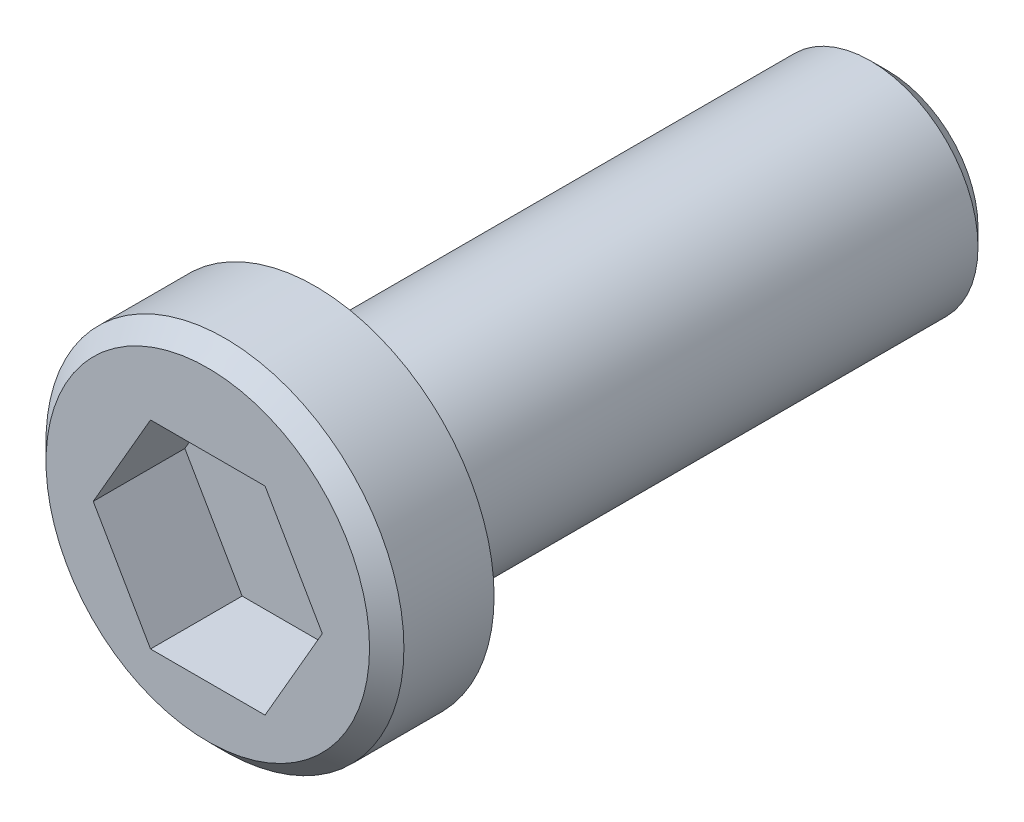
ISO-10303-21;
HEADER;
FILE_DESCRIPTION(('STEP AP214'),'2;1');
FILE_NAME('part.step','',(''),(''),'','','');
FILE_SCHEMA(('AUTOMOTIVE_DESIGN { 1 0 10303 214 1 1 1 1 }'));
ENDSEC;
DATA;
#1=APPLICATION_CONTEXT('core data for automotive mechanical design processes');
#2=APPLICATION_PROTOCOL_DEFINITION('international standard','automotive_design',2000,#1);
#3=PRODUCT_CONTEXT('',#1,'mechanical');
#4=PRODUCT('Part','Part','',(#3));
#5=PRODUCT_RELATED_PRODUCT_CATEGORY('part','',(#4));
#6=PRODUCT_DEFINITION_FORMATION('','',#4);
#7=PRODUCT_DEFINITION_CONTEXT('part definition',#1,'design');
#8=PRODUCT_DEFINITION('design','',#6,#7);
#9=PRODUCT_DEFINITION_SHAPE('','',#8);
#10=(LENGTH_UNIT() NAMED_UNIT(*) SI_UNIT(.MILLI.,.METRE.));
#11=(NAMED_UNIT(*) PLANE_ANGLE_UNIT() SI_UNIT($,.RADIAN.));
#12=(NAMED_UNIT(*) SI_UNIT($,.STERADIAN.) SOLID_ANGLE_UNIT());
#13=UNCERTAINTY_MEASURE_WITH_UNIT(LENGTH_MEASURE(1.E-05),#10,'distance_accuracy_value','');
#14=(GEOMETRIC_REPRESENTATION_CONTEXT(3) GLOBAL_UNCERTAINTY_ASSIGNED_CONTEXT((#13)) GLOBAL_UNIT_ASSIGNED_CONTEXT((#10,
#11,#12)) REPRESENTATION_CONTEXT('',''));
#15=CARTESIAN_POINT('',(0.,0.,0.));
#16=DIRECTION('',(0.,0.,1.));
#17=DIRECTION('',(1.,0.,0.));
#18=AXIS2_PLACEMENT_3D('',#15,#16,#17);
#19=CARTESIAN_POINT('',(0.,0.,25.4));
#20=DIRECTION('',(0.,0.,-1.));
#21=DIRECTION('',(-1.,0.,0.));
#22=AXIS2_PLACEMENT_3D('',#19,#20,#21);
#23=CYLINDRICAL_SURFACE('',#22,4.7625);
#24=CARTESIAN_POINT('',(0.,0.,0.761999999999999));
#25=DIRECTION('',(0.,0.,1.));
#26=DIRECTION('',(1.,0.,0.));
#27=AXIS2_PLACEMENT_3D('',#24,#25,#26);
#28=CIRCLE('',#27,4.7625);
#29=CARTESIAN_POINT('',(4.7625,0.,0.761999999999999));
#30=VERTEX_POINT('',#29);
#31=EDGE_CURVE('E147',#30,#30,#28,.T.);
#32=ORIENTED_EDGE('',*,*,#31,.T.);
#33=EDGE_LOOP('',(#32));
#34=FACE_BOUND('',#33,.T.);
#35=CARTESIAN_POINT('',(0.,0.,25.4));
#36=DIRECTION('',(0.,0.,1.));
#37=DIRECTION('',(1.,0.,0.));
#38=AXIS2_PLACEMENT_3D('',#35,#36,#37);
#39=CIRCLE('',#38,4.7625);
#40=CARTESIAN_POINT('',(4.7625,0.,25.4));
#41=VERTEX_POINT('',#40);
#42=EDGE_CURVE('E144',#41,#41,#39,.T.);
#43=ORIENTED_EDGE('',*,*,#42,.F.);
#44=EDGE_LOOP('',(#43));
#45=FACE_BOUND('',#44,.T.);
#46=ADVANCED_FACE('F34',(#34,#45),#23,.T.);
#47=CARTESIAN_POINT('',(0.,0.,0.));
#48=DIRECTION('',(0.,0.,1.));
#49=DIRECTION('',(1.,0.,0.));
#50=AXIS2_PLACEMENT_3D('',#47,#48,#49);
#51=PLANE('',#50);
#52=CARTESIAN_POINT('',(0.,0.,0.));
#53=DIRECTION('',(0.,0.,1.));
#54=DIRECTION('',(1.,0.,0.));
#55=AXIS2_PLACEMENT_3D('',#52,#53,#54);
#56=CIRCLE('',#55,4.0005);
#57=CARTESIAN_POINT('',(4.0005,0.,0.));
#58=VERTEX_POINT('',#57);
#59=EDGE_CURVE('E150',#58,#58,#56,.F.);
#60=ORIENTED_EDGE('',*,*,#59,.T.);
#61=EDGE_LOOP('',(#60));
#62=FACE_BOUND('',#61,.T.);
#63=ADVANCED_FACE('F170',(#62),#51,.F.);
#64=CARTESIAN_POINT('',(0.,0.491553117569765,25.4));
#65=DIRECTION('',(0.,0.,1.));
#66=DIRECTION('',(1.,0.,0.));
#67=AXIS2_PLACEMENT_3D('',#64,#65,#66);
#68=PLANE('',#67);
#69=CARTESIAN_POINT('',(0.,0.491553117569765,25.4));
#70=DIRECTION('',(0.,0.,1.));
#71=DIRECTION('',(1.,0.,0.));
#72=AXIS2_PLACEMENT_3D('',#69,#70,#71);
#73=CIRCLE('',#72,7.9375);
#74=CARTESIAN_POINT('',(7.9375,0.491553117569765,25.4));
#75=VERTEX_POINT('',#74);
#76=EDGE_CURVE('E136',#75,#75,#73,.T.);
#77=ORIENTED_EDGE('',*,*,#76,.F.);
#78=EDGE_LOOP('',(#77));
#79=FACE_BOUND('',#78,.T.);
#80=ORIENTED_EDGE('',*,*,#42,.T.);
#81=EDGE_LOOP('',(#80));
#82=FACE_BOUND('',#81,.T.);
#83=ADVANCED_FACE('F176',(#79,#82),#68,.F.);
#84=CARTESIAN_POINT('',(0.,0.491553117569765,30.1625));
#85=DIRECTION('',(0.,0.,-1.));
#86=DIRECTION('',(-1.,0.,0.));
#87=AXIS2_PLACEMENT_3D('',#84,#85,#86);
#88=CYLINDRICAL_SURFACE('',#87,7.9375);
#89=CARTESIAN_POINT('',(0.,0.491553117569765,29.4005));
#90=DIRECTION('',(0.,0.,1.));
#91=DIRECTION('',(1.,0.,0.));
#92=AXIS2_PLACEMENT_3D('',#89,#90,#91);
#93=CIRCLE('',#92,7.9375);
#94=CARTESIAN_POINT('',(7.9375,0.491553117569765,29.4005));
#95=VERTEX_POINT('',#94);
#96=EDGE_CURVE('E11',#95,#95,#93,.F.);
#97=ORIENTED_EDGE('',*,*,#96,.T.);
#98=EDGE_LOOP('',(#97));
#99=FACE_BOUND('',#98,.T.);
#100=ORIENTED_EDGE('',*,*,#76,.T.);
#101=EDGE_LOOP('',(#100));
#102=FACE_BOUND('',#101,.T.);
#103=ADVANCED_FACE('F181',(#99,#102),#88,.T.);
#104=CARTESIAN_POINT('',(0.,0.491553117569765,30.1625));
#105=DIRECTION('',(0.,0.,1.));
#106=DIRECTION('',(1.,0.,0.));
#107=AXIS2_PLACEMENT_3D('',#104,#105,#106);
#108=PLANE('',#107);
#109=DIRECTION('',(0.499999999999999,0.866025403784439,0.));
#110=VECTOR('',#109,1.);
#111=CARTESIAN_POINT('',(2.54,-4.39940905122495,30.1625));
#112=LINE('',#111,#110);
#113=CARTESIAN_POINT('',(2.54,-4.39940905122495,30.1625));
#114=VERTEX_POINT('',#113);
#115=CARTESIAN_POINT('',(5.08,0.,30.1625));
#116=VERTEX_POINT('',#115);
#117=EDGE_CURVE('E49',#114,#116,#112,.T.);
#118=ORIENTED_EDGE('',*,*,#117,.F.);
#119=DIRECTION('',(1.,0.,0.));
#120=VECTOR('',#119,1.);
#121=CARTESIAN_POINT('',(-2.54,-4.39940905122495,30.1625));
#122=LINE('',#121,#120);
#123=CARTESIAN_POINT('',(-2.54,-4.39940905122495,30.1625));
#124=VERTEX_POINT('',#123);
#125=EDGE_CURVE('E132',#124,#114,#122,.T.);
#126=ORIENTED_EDGE('',*,*,#125,.F.);
#127=DIRECTION('',(0.5,-0.866025403784438,0.));
#128=VECTOR('',#127,1.);
#129=CARTESIAN_POINT('',(-5.08,0.,30.1625));
#130=LINE('',#129,#128);
#131=CARTESIAN_POINT('',(-5.08,0.,30.1625));
#132=VERTEX_POINT('',#131);
#133=EDGE_CURVE('E130',#132,#124,#130,.T.);
#134=ORIENTED_EDGE('',*,*,#133,.F.);
#135=DIRECTION('',(-0.5,-0.866025403784439,0.));
#136=VECTOR('',#135,1.);
#137=CARTESIAN_POINT('',(-2.54,4.39940905122495,30.1625));
#138=LINE('',#137,#136);
#139=CARTESIAN_POINT('',(-2.54,4.39940905122495,30.1625));
#140=VERTEX_POINT('',#139);
#141=EDGE_CURVE('E97',#140,#132,#138,.T.);
#142=ORIENTED_EDGE('',*,*,#141,.F.);
#143=DIRECTION('',(-1.,0.,0.));
#144=VECTOR('',#143,1.);
#145=CARTESIAN_POINT('',(2.54,4.39940905122495,30.1625));
#146=LINE('',#145,#144);
#147=CARTESIAN_POINT('',(2.54,4.39940905122495,30.1625));
#148=VERTEX_POINT('',#147);
#149=EDGE_CURVE('E126',#148,#140,#146,.T.);
#150=ORIENTED_EDGE('',*,*,#149,.F.);
#151=DIRECTION('',(-0.5,0.866025403784438,0.));
#152=VECTOR('',#151,1.);
#153=CARTESIAN_POINT('',(5.08,0.,30.1625));
#154=LINE('',#153,#152);
#155=EDGE_CURVE('E123',#116,#148,#154,.T.);
#156=ORIENTED_EDGE('',*,*,#155,.F.);
#157=EDGE_LOOP('',(#118,#126,#134,#142,#150,#156));
#158=FACE_BOUND('',#157,.T.);
#159=CARTESIAN_POINT('',(0.,0.491553117569765,30.1625));
#160=DIRECTION('',(0.,0.,1.));
#161=DIRECTION('',(1.,0.,0.));
#162=AXIS2_PLACEMENT_3D('',#159,#160,#161);
#163=CIRCLE('',#162,7.1755);
#164=CARTESIAN_POINT('',(7.1755,0.491553117569765,30.1625));
#165=VERTEX_POINT('',#164);
#166=EDGE_CURVE('E42',#165,#165,#163,.T.);
#167=ORIENTED_EDGE('',*,*,#166,.T.);
#168=EDGE_LOOP('',(#167));
#169=FACE_BOUND('',#168,.T.);
#170=ADVANCED_FACE('F155',(#158,#169),#108,.T.);
#171=CARTESIAN_POINT('',(0.,0.,0.761999999999999));
#172=DIRECTION('',(0.,0.,1.));
#173=DIRECTION('',(1.,0.,0.));
#174=AXIS2_PLACEMENT_3D('',#171,#172,#173);
#175=CONICAL_SURFACE('',#174,4.7625,0.78539816339745);
#176=ORIENTED_EDGE('',*,*,#59,.F.);
#177=EDGE_LOOP('',(#176));
#178=FACE_BOUND('',#177,.T.);
#179=ORIENTED_EDGE('',*,*,#31,.F.);
#180=EDGE_LOOP('',(#179));
#181=FACE_BOUND('',#180,.T.);
#182=ADVANCED_FACE('F159',(#178,#181),#175,.T.);
#183=CARTESIAN_POINT('',(0.,0.491553117569765,30.1625));
#184=DIRECTION('',(0.,0.,-1.));
#185=DIRECTION('',(-1.,0.,0.));
#186=AXIS2_PLACEMENT_3D('',#183,#184,#185);
#187=CONICAL_SURFACE('',#186,7.1755,0.785398163397444);
#188=ORIENTED_EDGE('',*,*,#96,.F.);
#189=EDGE_LOOP('',(#188));
#190=FACE_BOUND('',#189,.T.);
#191=ORIENTED_EDGE('',*,*,#166,.F.);
#192=EDGE_LOOP('',(#191));
#193=FACE_BOUND('',#192,.T.);
#194=ADVANCED_FACE('F36',(#190,#193),#187,.T.);
#195=CARTESIAN_POINT('',(2.54,-4.39940905122495,26.0985));
#196=DIRECTION('',(0.866025403784439,-0.5,0.));
#197=DIRECTION('',(0.5,0.866025403784439,0.));
#198=AXIS2_PLACEMENT_3D('',#195,#196,#197);
#199=PLANE('',#198);
#200=ORIENTED_EDGE('',*,*,#117,.T.);
#201=DIRECTION('',(0.,0.,1.));
#202=VECTOR('',#201,1.);
#203=CARTESIAN_POINT('',(5.08,0.,26.0985));
#204=LINE('',#203,#202);
#205=CARTESIAN_POINT('',(5.08,0.,26.0985));
#206=VERTEX_POINT('',#205);
#207=EDGE_CURVE('E79',#206,#116,#204,.T.);
#208=ORIENTED_EDGE('',*,*,#207,.F.);
#209=DIRECTION('',(0.499999999999999,0.866025403784439,0.));
#210=VECTOR('',#209,1.);
#211=CARTESIAN_POINT('',(2.54,-4.39940905122495,26.0985));
#212=LINE('',#211,#210);
#213=CARTESIAN_POINT('',(2.54,-4.39940905122495,26.0985));
#214=VERTEX_POINT('',#213);
#215=EDGE_CURVE('E134',#214,#206,#212,.T.);
#216=ORIENTED_EDGE('',*,*,#215,.F.);
#217=DIRECTION('',(0.,0.,1.));
#218=VECTOR('',#217,1.);
#219=CARTESIAN_POINT('',(2.54,-4.39940905122495,26.0985));
#220=LINE('',#219,#218);
#221=EDGE_CURVE('E57',#214,#114,#220,.T.);
#222=ORIENTED_EDGE('',*,*,#221,.T.);
#223=EDGE_LOOP('',(#200,#208,#216,#222));
#224=FACE_BOUND('',#223,.T.);
#225=ADVANCED_FACE('F158',(#224),#199,.F.);
#226=CARTESIAN_POINT('',(-2.54,-4.39940905122495,26.0985));
#227=DIRECTION('',(0.,-1.,0.));
#228=DIRECTION('',(1.,0.,0.));
#229=AXIS2_PLACEMENT_3D('',#226,#227,#228);
#230=PLANE('',#229);
#231=ORIENTED_EDGE('',*,*,#125,.T.);
#232=ORIENTED_EDGE('',*,*,#221,.F.);
#233=DIRECTION('',(1.,0.,0.));
#234=VECTOR('',#233,1.);
#235=CARTESIAN_POINT('',(-2.54,-4.39940905122495,26.0985));
#236=LINE('',#235,#234);
#237=CARTESIAN_POINT('',(-2.54,-4.39940905122495,26.0985));
#238=VERTEX_POINT('',#237);
#239=EDGE_CURVE('E109',#238,#214,#236,.T.);
#240=ORIENTED_EDGE('',*,*,#239,.F.);
#241=DIRECTION('',(0.,0.,1.));
#242=VECTOR('',#241,1.);
#243=CARTESIAN_POINT('',(-2.54,-4.39940905122495,26.0985));
#244=LINE('',#243,#242);
#245=EDGE_CURVE('E101',#238,#124,#244,.T.);
#246=ORIENTED_EDGE('',*,*,#245,.T.);
#247=EDGE_LOOP('',(#231,#232,#240,#246));
#248=FACE_BOUND('',#247,.T.);
#249=ADVANCED_FACE('F165',(#248),#230,.F.);
#250=CARTESIAN_POINT('',(-5.08,0.,26.0985));
#251=DIRECTION('',(-0.866025403784439,-0.5,0.));
#252=DIRECTION('',(0.5,-0.866025403784439,0.));
#253=AXIS2_PLACEMENT_3D('',#250,#251,#252);
#254=PLANE('',#253);
#255=ORIENTED_EDGE('',*,*,#133,.T.);
#256=ORIENTED_EDGE('',*,*,#245,.F.);
#257=DIRECTION('',(0.5,-0.866025403784438,0.));
#258=VECTOR('',#257,1.);
#259=CARTESIAN_POINT('',(-5.08,0.,26.0985));
#260=LINE('',#259,#258);
#261=CARTESIAN_POINT('',(-5.08,0.,26.0985));
#262=VERTEX_POINT('',#261);
#263=EDGE_CURVE('E105',#262,#238,#260,.T.);
#264=ORIENTED_EDGE('',*,*,#263,.F.);
#265=DIRECTION('',(0.,0.,1.));
#266=VECTOR('',#265,1.);
#267=CARTESIAN_POINT('',(-5.08,0.,26.0985));
#268=LINE('',#267,#266);
#269=EDGE_CURVE('E90',#262,#132,#268,.T.);
#270=ORIENTED_EDGE('',*,*,#269,.T.);
#271=EDGE_LOOP('',(#255,#256,#264,#270));
#272=FACE_BOUND('',#271,.T.);
#273=ADVANCED_FACE('F106',(#272),#254,.F.);
#274=CARTESIAN_POINT('',(-2.54,4.39940905122495,26.0985));
#275=DIRECTION('',(-0.866025403784439,0.5,0.));
#276=DIRECTION('',(-0.5,-0.866025403784439,0.));
#277=AXIS2_PLACEMENT_3D('',#274,#275,#276);
#278=PLANE('',#277);
#279=ORIENTED_EDGE('',*,*,#141,.T.);
#280=ORIENTED_EDGE('',*,*,#269,.F.);
#281=DIRECTION('',(-0.5,-0.866025403784439,0.));
#282=VECTOR('',#281,1.);
#283=CARTESIAN_POINT('',(-2.54,4.39940905122495,26.0985));
#284=LINE('',#283,#282);
#285=CARTESIAN_POINT('',(-2.54,4.39940905122495,26.0985));
#286=VERTEX_POINT('',#285);
#287=EDGE_CURVE('E94',#286,#262,#284,.T.);
#288=ORIENTED_EDGE('',*,*,#287,.F.);
#289=DIRECTION('',(0.,0.,1.));
#290=VECTOR('',#289,1.);
#291=CARTESIAN_POINT('',(-2.54,4.39940905122495,26.0985));
#292=LINE('',#291,#290);
#293=EDGE_CURVE('E102',#286,#140,#292,.T.);
#294=ORIENTED_EDGE('',*,*,#293,.T.);
#295=EDGE_LOOP('',(#279,#280,#288,#294));
#296=FACE_BOUND('',#295,.T.);
#297=ADVANCED_FACE('F92',(#296),#278,.F.);
#298=CARTESIAN_POINT('',(2.54,4.39940905122495,26.0985));
#299=DIRECTION('',(0.,1.,0.));
#300=DIRECTION('',(0.,0.,1.));
#301=AXIS2_PLACEMENT_3D('',#298,#299,#300);
#302=PLANE('',#301);
#303=ORIENTED_EDGE('',*,*,#149,.T.);
#304=ORIENTED_EDGE('',*,*,#293,.F.);
#305=DIRECTION('',(-1.,0.,0.));
#306=VECTOR('',#305,1.);
#307=CARTESIAN_POINT('',(2.54,4.39940905122495,26.0985));
#308=LINE('',#307,#306);
#309=CARTESIAN_POINT('',(2.54,4.39940905122495,26.0985));
#310=VERTEX_POINT('',#309);
#311=EDGE_CURVE('E115',#310,#286,#308,.T.);
#312=ORIENTED_EDGE('',*,*,#311,.F.);
#313=DIRECTION('',(0.,0.,1.));
#314=VECTOR('',#313,1.);
#315=CARTESIAN_POINT('',(2.54,4.39940905122495,26.0985));
#316=LINE('',#315,#314);
#317=EDGE_CURVE('E139',#310,#148,#316,.T.);
#318=ORIENTED_EDGE('',*,*,#317,.T.);
#319=EDGE_LOOP('',(#303,#304,#312,#318));
#320=FACE_BOUND('',#319,.T.);
#321=ADVANCED_FACE('F194',(#320),#302,.F.);
#322=CARTESIAN_POINT('',(5.08,0.,26.0985));
#323=DIRECTION('',(0.866025403784438,0.5,0.));
#324=DIRECTION('',(-0.5,0.866025403784439,0.));
#325=AXIS2_PLACEMENT_3D('',#322,#323,#324);
#326=PLANE('',#325);
#327=ORIENTED_EDGE('',*,*,#155,.T.);
#328=ORIENTED_EDGE('',*,*,#317,.F.);
#329=DIRECTION('',(-0.5,0.866025403784438,0.));
#330=VECTOR('',#329,1.);
#331=CARTESIAN_POINT('',(5.08,0.,26.0985));
#332=LINE('',#331,#330);
#333=EDGE_CURVE('E117',#206,#310,#332,.T.);
#334=ORIENTED_EDGE('',*,*,#333,.F.);
#335=ORIENTED_EDGE('',*,*,#207,.T.);
#336=EDGE_LOOP('',(#327,#328,#334,#335));
#337=FACE_BOUND('',#336,.T.);
#338=ADVANCED_FACE('F191',(#337),#326,.F.);
#339=CARTESIAN_POINT('',(7.62,4.39940905122495,26.0985));
#340=DIRECTION('',(0.,0.,1.));
#341=DIRECTION('',(1.,0.,0.));
#342=AXIS2_PLACEMENT_3D('',#339,#340,#341);
#343=PLANE('',#342);
#344=ORIENTED_EDGE('',*,*,#215,.T.);
#345=ORIENTED_EDGE('',*,*,#333,.T.);
#346=ORIENTED_EDGE('',*,*,#311,.T.);
#347=ORIENTED_EDGE('',*,*,#287,.T.);
#348=ORIENTED_EDGE('',*,*,#263,.T.);
#349=ORIENTED_EDGE('',*,*,#239,.T.);
#350=EDGE_LOOP('',(#344,#345,#346,#347,#348,#349));
#351=FACE_BOUND('',#350,.T.);
#352=ADVANCED_FACE('F112',(#351),#343,.T.);
#353=CLOSED_SHELL('',(#46,#63,#83,#103,#170,#182,#194,#225,#249,#273,#297,#321,#338,#352));
#354=MANIFOLD_SOLID_BREP('B2',#353);
#355=ADVANCED_BREP_SHAPE_REPRESENTATION('',(#18,#354),#14);
#356=SHAPE_DEFINITION_REPRESENTATION(#9,#355);
ENDSEC;
END-ISO-10303-21;
